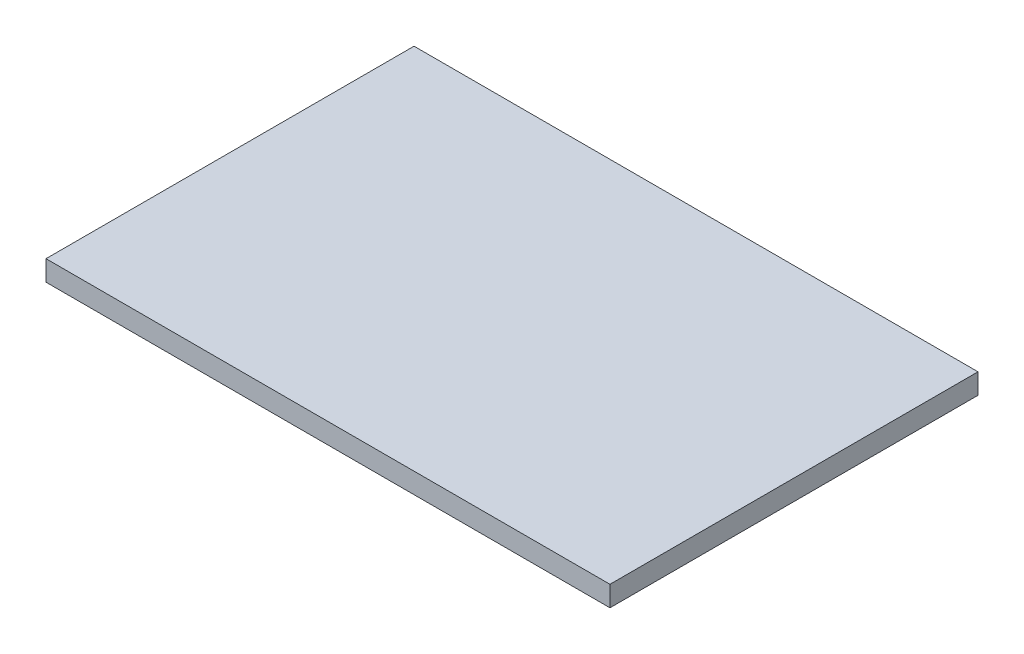
ISO-10303-21;
HEADER;
FILE_DESCRIPTION(('STEP AP214'),'2;1');
FILE_NAME('part.step','',(''),(''),'','','');
FILE_SCHEMA(('AUTOMOTIVE_DESIGN { 1 0 10303 214 1 1 1 1 }'));
ENDSEC;
DATA;
#1=APPLICATION_CONTEXT('core data for automotive mechanical design processes');
#2=APPLICATION_PROTOCOL_DEFINITION('international standard','automotive_design',2000,#1);
#3=PRODUCT_CONTEXT('',#1,'mechanical');
#4=PRODUCT('Part','Part','',(#3));
#5=PRODUCT_RELATED_PRODUCT_CATEGORY('part','',(#4));
#6=PRODUCT_DEFINITION_FORMATION('','',#4);
#7=PRODUCT_DEFINITION_CONTEXT('part definition',#1,'design');
#8=PRODUCT_DEFINITION('design','',#6,#7);
#9=PRODUCT_DEFINITION_SHAPE('','',#8);
#10=(LENGTH_UNIT() NAMED_UNIT(*) SI_UNIT(.MILLI.,.METRE.));
#11=(NAMED_UNIT(*) PLANE_ANGLE_UNIT() SI_UNIT($,.RADIAN.));
#12=(NAMED_UNIT(*) SI_UNIT($,.STERADIAN.) SOLID_ANGLE_UNIT());
#13=UNCERTAINTY_MEASURE_WITH_UNIT(LENGTH_MEASURE(1.E-05),#10,'distance_accuracy_value','');
#14=(GEOMETRIC_REPRESENTATION_CONTEXT(3) GLOBAL_UNCERTAINTY_ASSIGNED_CONTEXT((#13)) GLOBAL_UNIT_ASSIGNED_CONTEXT((#10,
#11,#12)) REPRESENTATION_CONTEXT('',''));
#15=CARTESIAN_POINT('',(0.,0.,0.));
#16=DIRECTION('',(0.,0.,1.));
#17=DIRECTION('',(1.,0.,0.));
#18=AXIS2_PLACEMENT_3D('',#15,#16,#17);
#19=CARTESIAN_POINT('',(-249.,18.,162.5));
#20=DIRECTION('',(1.,0.,0.));
#21=DIRECTION('',(0.,0.,-1.));
#22=AXIS2_PLACEMENT_3D('',#19,#20,#21);
#23=PLANE('',#22);
#24=DIRECTION('',(0.,0.,1.));
#25=VECTOR('',#24,1.);
#26=CARTESIAN_POINT('',(-249.,0.,162.5));
#27=LINE('',#26,#25);
#28=CARTESIAN_POINT('',(-249.,0.,-162.5));
#29=VERTEX_POINT('',#28);
#30=CARTESIAN_POINT('',(-249.,0.,162.5));
#31=VERTEX_POINT('',#30);
#32=EDGE_CURVE('E98',#29,#31,#27,.T.);
#33=ORIENTED_EDGE('',*,*,#32,.T.);
#34=DIRECTION('',(0.,-1.,0.));
#35=VECTOR('',#34,1.);
#36=CARTESIAN_POINT('',(-249.,18.,162.5));
#37=LINE('',#36,#35);
#38=CARTESIAN_POINT('',(-249.,18.,162.5));
#39=VERTEX_POINT('',#38);
#40=EDGE_CURVE('E11',#39,#31,#37,.T.);
#41=ORIENTED_EDGE('',*,*,#40,.F.);
#42=DIRECTION('',(0.,0.,1.));
#43=VECTOR('',#42,1.);
#44=CARTESIAN_POINT('',(-249.,18.,162.5));
#45=LINE('',#44,#43);
#46=CARTESIAN_POINT('',(-249.,18.,-162.5));
#47=VERTEX_POINT('',#46);
#48=EDGE_CURVE('E86',#47,#39,#45,.T.);
#49=ORIENTED_EDGE('',*,*,#48,.F.);
#50=DIRECTION('',(0.,-1.,0.));
#51=VECTOR('',#50,1.);
#52=CARTESIAN_POINT('',(-249.,18.,-162.5));
#53=LINE('',#52,#51);
#54=EDGE_CURVE('E94',#47,#29,#53,.T.);
#55=ORIENTED_EDGE('',*,*,#54,.T.);
#56=EDGE_LOOP('',(#33,#41,#49,#55));
#57=FACE_BOUND('',#56,.T.);
#58=ADVANCED_FACE('F35',(#57),#23,.F.);
#59=CARTESIAN_POINT('',(249.,18.,162.5));
#60=DIRECTION('',(0.,0.,-1.));
#61=DIRECTION('',(-1.,0.,0.));
#62=AXIS2_PLACEMENT_3D('',#59,#60,#61);
#63=PLANE('',#62);
#64=DIRECTION('',(1.,0.,0.));
#65=VECTOR('',#64,1.);
#66=CARTESIAN_POINT('',(249.,0.,162.5));
#67=LINE('',#66,#65);
#68=CARTESIAN_POINT('',(249.,0.,162.5));
#69=VERTEX_POINT('',#68);
#70=EDGE_CURVE('E90',#31,#69,#67,.T.);
#71=ORIENTED_EDGE('',*,*,#70,.T.);
#72=DIRECTION('',(0.,-1.,0.));
#73=VECTOR('',#72,1.);
#74=CARTESIAN_POINT('',(249.,18.,162.5));
#75=LINE('',#74,#73);
#76=CARTESIAN_POINT('',(249.,18.,162.5));
#77=VERTEX_POINT('',#76);
#78=EDGE_CURVE('E43',#77,#69,#75,.T.);
#79=ORIENTED_EDGE('',*,*,#78,.F.);
#80=DIRECTION('',(1.,0.,0.));
#81=VECTOR('',#80,1.);
#82=CARTESIAN_POINT('',(249.,18.,162.5));
#83=LINE('',#82,#81);
#84=EDGE_CURVE('E81',#39,#77,#83,.T.);
#85=ORIENTED_EDGE('',*,*,#84,.F.);
#86=ORIENTED_EDGE('',*,*,#40,.T.);
#87=EDGE_LOOP('',(#71,#79,#85,#86));
#88=FACE_BOUND('',#87,.T.);
#89=ADVANCED_FACE('F89',(#88),#63,.F.);
#90=CARTESIAN_POINT('',(249.,18.,162.5));
#91=DIRECTION('',(-1.,0.,0.));
#92=DIRECTION('',(0.,0.,1.));
#93=AXIS2_PLACEMENT_3D('',#90,#91,#92);
#94=PLANE('',#93);
#95=DIRECTION('',(0.,0.,-1.));
#96=VECTOR('',#95,1.);
#97=CARTESIAN_POINT('',(249.,0.,162.5));
#98=LINE('',#97,#96);
#99=CARTESIAN_POINT('',(249.,0.,-162.5));
#100=VERTEX_POINT('',#99);
#101=EDGE_CURVE('E68',#69,#100,#98,.T.);
#102=ORIENTED_EDGE('',*,*,#101,.T.);
#103=DIRECTION('',(0.,-1.,0.));
#104=VECTOR('',#103,1.);
#105=CARTESIAN_POINT('',(249.,18.,-162.5));
#106=LINE('',#105,#104);
#107=CARTESIAN_POINT('',(249.,18.,-162.5));
#108=VERTEX_POINT('',#107);
#109=EDGE_CURVE('E91',#108,#100,#106,.T.);
#110=ORIENTED_EDGE('',*,*,#109,.F.);
#111=DIRECTION('',(0.,0.,-1.));
#112=VECTOR('',#111,1.);
#113=CARTESIAN_POINT('',(249.,18.,162.5));
#114=LINE('',#113,#112);
#115=EDGE_CURVE('E84',#77,#108,#114,.T.);
#116=ORIENTED_EDGE('',*,*,#115,.F.);
#117=ORIENTED_EDGE('',*,*,#78,.T.);
#118=EDGE_LOOP('',(#102,#110,#116,#117));
#119=FACE_BOUND('',#118,.T.);
#120=ADVANCED_FACE('F92',(#119),#94,.F.);
#121=CARTESIAN_POINT('',(249.,18.,-162.5));
#122=DIRECTION('',(0.,0.,1.));
#123=DIRECTION('',(1.,0.,0.));
#124=AXIS2_PLACEMENT_3D('',#121,#122,#123);
#125=PLANE('',#124);
#126=DIRECTION('',(-1.,0.,0.));
#127=VECTOR('',#126,1.);
#128=CARTESIAN_POINT('',(249.,0.,-162.5));
#129=LINE('',#128,#127);
#130=EDGE_CURVE('E74',#100,#29,#129,.T.);
#131=ORIENTED_EDGE('',*,*,#130,.T.);
#132=ORIENTED_EDGE('',*,*,#54,.F.);
#133=DIRECTION('',(-1.,0.,0.));
#134=VECTOR('',#133,1.);
#135=CARTESIAN_POINT('',(249.,18.,-162.5));
#136=LINE('',#135,#134);
#137=EDGE_CURVE('E51',#108,#47,#136,.T.);
#138=ORIENTED_EDGE('',*,*,#137,.F.);
#139=ORIENTED_EDGE('',*,*,#109,.T.);
#140=EDGE_LOOP('',(#131,#132,#138,#139));
#141=FACE_BOUND('',#140,.T.);
#142=ADVANCED_FACE('F105',(#141),#125,.F.);
#143=CARTESIAN_POINT('',(0.,18.,0.));
#144=DIRECTION('',(0.,1.,0.));
#145=DIRECTION('',(0.,0.,1.));
#146=AXIS2_PLACEMENT_3D('',#143,#144,#145);
#147=PLANE('',#146);
#148=ORIENTED_EDGE('',*,*,#48,.T.);
#149=ORIENTED_EDGE('',*,*,#84,.T.);
#150=ORIENTED_EDGE('',*,*,#115,.T.);
#151=ORIENTED_EDGE('',*,*,#137,.T.);
#152=EDGE_LOOP('',(#148,#149,#150,#151));
#153=FACE_BOUND('',#152,.T.);
#154=ADVANCED_FACE('F82',(#153),#147,.T.);
#155=CARTESIAN_POINT('',(0.,0.,0.));
#156=DIRECTION('',(0.,1.,0.));
#157=DIRECTION('',(0.,0.,1.));
#158=AXIS2_PLACEMENT_3D('',#155,#156,#157);
#159=PLANE('',#158);
#160=ORIENTED_EDGE('',*,*,#32,.F.);
#161=ORIENTED_EDGE('',*,*,#130,.F.);
#162=ORIENTED_EDGE('',*,*,#101,.F.);
#163=ORIENTED_EDGE('',*,*,#70,.F.);
#164=EDGE_LOOP('',(#160,#161,#162,#163));
#165=FACE_BOUND('',#164,.T.);
#166=ADVANCED_FACE('F108',(#165),#159,.F.);
#167=CLOSED_SHELL('',(#58,#89,#120,#142,#154,#166));
#168=MANIFOLD_SOLID_BREP('B2',#167);
#169=ADVANCED_BREP_SHAPE_REPRESENTATION('',(#18,#168),#14);
#170=SHAPE_DEFINITION_REPRESENTATION(#9,#169);
ENDSEC;
END-ISO-10303-21;
